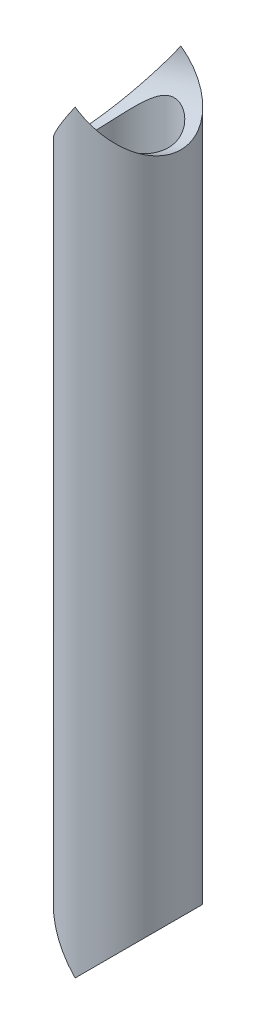
ISO-10303-21;
HEADER;
FILE_DESCRIPTION(('STEP AP214'),'2;1');
FILE_NAME('part.step','',(''),(''),'','','');
FILE_SCHEMA(('AUTOMOTIVE_DESIGN { 1 0 10303 214 1 1 1 1 }'));
ENDSEC;
DATA;
#1=APPLICATION_CONTEXT('core data for automotive mechanical design processes');
#2=APPLICATION_PROTOCOL_DEFINITION('international standard','automotive_design',2000,#1);
#3=PRODUCT_CONTEXT('',#1,'mechanical');
#4=PRODUCT('Part','Part','',(#3));
#5=PRODUCT_RELATED_PRODUCT_CATEGORY('part','',(#4));
#6=PRODUCT_DEFINITION_FORMATION('','',#4);
#7=PRODUCT_DEFINITION_CONTEXT('part definition',#1,'design');
#8=PRODUCT_DEFINITION('design','',#6,#7);
#9=PRODUCT_DEFINITION_SHAPE('','',#8);
#10=(LENGTH_UNIT() NAMED_UNIT(*) SI_UNIT(.MILLI.,.METRE.));
#11=(NAMED_UNIT(*) PLANE_ANGLE_UNIT() SI_UNIT($,.RADIAN.));
#12=(NAMED_UNIT(*) SI_UNIT($,.STERADIAN.) SOLID_ANGLE_UNIT());
#13=UNCERTAINTY_MEASURE_WITH_UNIT(LENGTH_MEASURE(1.E-05),#10,'distance_accuracy_value','');
#14=(GEOMETRIC_REPRESENTATION_CONTEXT(3) GLOBAL_UNCERTAINTY_ASSIGNED_CONTEXT((#13)) GLOBAL_UNIT_ASSIGNED_CONTEXT((#10,
#11,#12)) REPRESENTATION_CONTEXT('',''));
#15=CARTESIAN_POINT('',(0.,0.,0.));
#16=DIRECTION('',(0.,0.,1.));
#17=DIRECTION('',(1.,0.,0.));
#18=AXIS2_PLACEMENT_3D('',#15,#16,#17);
#19=CARTESIAN_POINT('',(2299.99999999996,181.249999999997,-275.000000000001));
#20=DIRECTION('',(0.,-1.,0.));
#21=DIRECTION('',(0.,0.,-1.));
#22=AXIS2_PLACEMENT_3D('',#19,#20,#21);
#23=CYLINDRICAL_SURFACE('',#22,12.6999999999999);
#24=CARTESIAN_POINT('',(2299.99999999996,181.249999999996,-275.000000000001));
#25=DIRECTION('',(0.818779373097968,-0.57410829831078,0.));
#26=DIRECTION('',(-0.574108298310781,-0.818779373097967,0.));
#27=AXIS2_PLACEMENT_3D('',#24,#25,#26);
#28=ELLIPSE('',#27,22.1212618548932,12.6999999999999);
#29=CARTESIAN_POINT('',(2299.99999999996,181.249999999997,-287.700000000001));
#30=VERTEX_POINT('',#29);
#31=CARTESIAN_POINT('',(2299.99999999996,181.249999999997,-262.300000000001));
#32=VERTEX_POINT('',#31);
#33=EDGE_CURVE('E58',#30,#32,#28,.F.);
#34=ORIENTED_EDGE('',*,*,#33,.F.);
#35=CARTESIAN_POINT('',(2299.99999999996,181.249999999996,-275.000000000001));
#36=DIRECTION('',(-0.574108298310781,-0.818779373097967,0.));
#37=DIRECTION('',(0.818779373097968,-0.57410829831078,0.));
#38=AXIS2_PLACEMENT_3D('',#35,#36,#37);
#39=ELLIPSE('',#38,15.5108939199918,12.6999999999999);
#40=EDGE_CURVE('E93',#32,#30,#39,.F.);
#41=ORIENTED_EDGE('',*,*,#40,.F.);
#42=EDGE_LOOP('',(#34,#41));
#43=FACE_BOUND('',#42,.T.);
#44=CARTESIAN_POINT('',(2299.99999999996,-1.51267887105178E-12,-275.000000000001));
#45=DIRECTION('',(0.70710678118655,-0.707106781186546,0.));
#46=DIRECTION('',(-0.707106781186546,-0.707106781186549,0.));
#47=AXIS2_PLACEMENT_3D('',#44,#45,#46);
#48=ELLIPSE('',#47,17.9605122421383,12.6999999999999);
#49=CARTESIAN_POINT('',(2299.99999999996,-1.5404344466674E-12,-287.700000000001));
#50=VERTEX_POINT('',#49);
#51=CARTESIAN_POINT('',(2299.99999999996,-4.16333634234434E-12,-262.300000000001));
#52=VERTEX_POINT('',#51);
#53=EDGE_CURVE('E75',#50,#52,#48,.T.);
#54=ORIENTED_EDGE('',*,*,#53,.F.);
#55=CARTESIAN_POINT('',(2299.99999999996,-1.51267887105178E-12,-275.000000000001));
#56=DIRECTION('',(-0.707106781186546,-0.707106781186549,0.));
#57=DIRECTION('',(0.70710678118655,-0.707106781186546,0.));
#58=AXIS2_PLACEMENT_3D('',#55,#56,#57);
#59=ELLIPSE('',#58,17.9605122421382,12.6999999999999);
#60=EDGE_CURVE('E82',#52,#50,#59,.T.);
#61=ORIENTED_EDGE('',*,*,#60,.F.);
#62=EDGE_LOOP('',(#54,#61));
#63=FACE_BOUND('',#62,.T.);
#64=ADVANCED_FACE('F44',(#43,#63),#23,.T.);
#65=CARTESIAN_POINT('',(1799.99999999996,-4.20496970576778E-12,-275.000000000001));
#66=DIRECTION('',(0.940136065162483,0.3407993236214,0.));
#67=DIRECTION('',(-0.3407993236214,0.940136065162483,0.));
#68=AXIS2_PLACEMENT_3D('',#65,#66,#67);
#69=CYLINDRICAL_SURFACE('',#68,12.7);
#70=CARTESIAN_POINT('',(2299.99999999996,172.467908247635,-284.650000000001));
#71=CARTESIAN_POINT('',(2299.73053482446,172.370218189027,-284.649997759306));
#72=CARTESIAN_POINT('',(2299.46554248098,172.260056766113,-284.638694372456));
#73=CARTESIAN_POINT('',(2298.94662265408,172.019153605129,-284.595878168783));
#74=CARTESIAN_POINT('',(2298.69270935676,171.888386416019,-284.564340209438));
#75=CARTESIAN_POINT('',(2298.1952072461,171.610087485636,-284.483098979186));
#76=CARTESIAN_POINT('',(2297.95169548143,171.46245317265,-284.433279994711));
#77=CARTESIAN_POINT('',(2297.4764958178,171.15532292964,-284.317415065042));
#78=CARTESIAN_POINT('',(2297.24480572008,170.99582921905,-284.251372150784));
#79=CARTESIAN_POINT('',(2296.70031175359,170.60176101783,-284.07450685215));
#80=CARTESIAN_POINT('',(2296.39287128243,170.36304733443,-283.956398954751));
#81=CARTESIAN_POINT('',(2295.79746676399,169.876438195739,-283.692940414183));
#82=CARTESIAN_POINT('',(2295.50951387501,169.628537603784,-283.547574340008));
#83=CARTESIAN_POINT('',(2294.95184407707,169.129663568345,-283.230515777692));
#84=CARTESIAN_POINT('',(2294.68211252106,168.878692789196,-283.058844806216));
#85=CARTESIAN_POINT('',(2294.16001321391,168.378499187879,-282.688911920102));
#86=CARTESIAN_POINT('',(2293.9076385082,168.129275701977,-282.490660750671));
#87=CARTESIAN_POINT('',(2293.46834534704,167.685553799704,-282.108252687632));
#88=CARTESIAN_POINT('',(2293.27830943162,167.489924907236,-281.928981075182));
#89=CARTESIAN_POINT('',(2292.91021399962,167.105291024418,-281.551861442901));
#90=CARTESIAN_POINT('',(2292.73215545709,166.916286573392,-281.354011915367));
#91=CARTESIAN_POINT('',(2292.38954262194,166.548141986001,-280.939324997215));
#92=CARTESIAN_POINT('',(2292.22496102757,166.368982161477,-280.722527931348));
#93=CARTESIAN_POINT('',(2291.91073877806,166.023518665575,-280.269013329519));
#94=CARTESIAN_POINT('',(2291.76109145339,165.857209262865,-280.032304773692));
#95=CARTESIAN_POINT('',(2291.42811875588,165.484212809176,-279.449133380189));
#96=CARTESIAN_POINT('',(2291.25201934174,165.28449610461,-279.093800231935));
#97=CARTESIAN_POINT('',(2291.01788618172,165.017004988662,-278.533432042647));
#98=CARTESIAN_POINT('',(2290.94485426117,164.93320005845,-278.342115872068));
#99=CARTESIAN_POINT('',(2290.80987402723,164.777818732797,-277.950741999339));
#100=CARTESIAN_POINT('',(2290.74792389831,164.706240334358,-277.750685735781));
#101=CARTESIAN_POINT('',(2290.64532866594,164.587410751901,-277.375727045156));
#102=CARTESIAN_POINT('',(2290.60285878446,164.53809782102,-277.201974600978));
#103=CARTESIAN_POINT('',(2290.52724317586,164.450159626415,-276.849808707908));
#104=CARTESIAN_POINT('',(2290.49409554138,164.411532176434,-276.671396220652));
#105=CARTESIAN_POINT('',(2290.43772976295,164.345777021796,-276.311004460584));
#106=CARTESIAN_POINT('',(2290.41450644775,164.318643328177,-276.129027097142));
#107=CARTESIAN_POINT('',(2290.37842269942,164.276458788866,-275.762646568441));
#108=CARTESIAN_POINT('',(2290.365562346,164.261408036111,-275.578243384535));
#109=CARTESIAN_POINT('',(2290.35045422322,164.243724881254,-275.207875761226));
#110=CARTESIAN_POINT('',(2290.34823683894,164.241128034375,-275.021908368404));
#111=CARTESIAN_POINT('',(2290.3545451394,164.248513004529,-274.650407901026));
#112=CARTESIAN_POINT('',(2290.36307085271,164.258494855011,-274.464874827626));
#113=CARTESIAN_POINT('',(2290.39068647275,164.290798807495,-274.095631182327));
#114=CARTESIAN_POINT('',(2290.40977958537,164.313124654349,-273.911921180728));
#115=CARTESIAN_POINT('',(2290.45814082542,164.36959754008,-273.547698809239));
#116=CARTESIAN_POINT('',(2290.48740903575,164.403744675258,-273.367186465411));
#117=CARTESIAN_POINT('',(2290.55434681284,164.481697765372,-273.01687371838));
#118=CARTESIAN_POINT('',(2290.59167801869,164.525114076771,-272.846921196638));
#119=CARTESIAN_POINT('',(2290.67470231858,164.62145879688,-272.51179726154));
#120=CARTESIAN_POINT('',(2290.7203979906,164.674390138094,-272.346627340442));
#121=CARTESIAN_POINT('',(2290.8690598963,164.846137884352,-271.859354085998));
#122=CARTESIAN_POINT('',(2290.98363651566,164.977949601629,-271.545306792955));
#123=CARTESIAN_POINT('',(2291.31041125978,165.35107940232,-270.772028486017));
#124=CARTESIAN_POINT('',(2291.54129786457,165.612324908465,-270.33030385345));
#125=CARTESIAN_POINT('',(2291.92329019123,166.037194799253,-269.713398596103));
#126=CARTESIAN_POINT('',(2292.05684633344,166.184623291186,-269.515051232876));
#127=CARTESIAN_POINT('',(2292.33466133954,166.488321702911,-269.133078115759));
#128=CARTESIAN_POINT('',(2292.47891986943,166.644591346763,-268.94945190284));
#129=CARTESIAN_POINT('',(2292.84455761016,167.036171481727,-268.516565852519));
#130=CARTESIAN_POINT('',(2293.0712854897,167.275238390509,-268.275225365091));
#131=CARTESIAN_POINT('',(2293.54309049028,167.76229425933,-267.820995665739));
#132=CARTESIAN_POINT('',(2293.78817765643,168.010288064522,-267.608122209324));
#133=CARTESIAN_POINT('',(2294.29602912652,168.510492327589,-267.209523819256));
#134=CARTESIAN_POINT('',(2294.55880902725,168.762706354603,-267.023823309438));
#135=CARTESIAN_POINT('',(2295.10199813402,169.266241985688,-266.679210978262));
#136=CARTESIAN_POINT('',(2295.3823999999,169.517563915863,-266.520288103288));
#137=CARTESIAN_POINT('',(2295.88312564491,169.946335024737,-266.26905215604));
#138=CARTESIAN_POINT('',(2296.09901438737,170.125262695582,-266.170385637131));
#139=CARTESIAN_POINT('',(2296.54158878963,170.477335026015,-265.987829743365));
#140=CARTESIAN_POINT('',(2296.76827515228,170.650479307888,-265.903941332144));
#141=CARTESIAN_POINT('',(2297.23271049986,170.987508301407,-265.752072536941));
#142=CARTESIAN_POINT('',(2297.47043127628,171.151414482954,-265.684054007376));
#143=CARTESIAN_POINT('',(2297.95819292835,171.466641412139,-265.565145386283));
#144=CARTESIAN_POINT('',(2298.20822810032,171.617967900637,-265.514247448949));
#145=CARTESIAN_POINT('',(2298.63986546246,171.858377782197,-265.444685248814));
#146=CARTESIAN_POINT('',(2298.8181143464,171.952015177421,-265.420917602166));
#147=CARTESIAN_POINT('',(2299.18032461408,172.129673692137,-265.383151750566));
#148=CARTESIAN_POINT('',(2299.36428407882,172.213697998511,-265.369150300084));
#149=CARTESIAN_POINT('',(2299.73718388123,172.370416599529,-265.351777100898));
#150=CARTESIAN_POINT('',(2299.92611672571,172.443126912917,-265.348390191191));
#151=CARTESIAN_POINT('',(2300.30827256465,172.575886347668,-265.35303313427));
#152=CARTESIAN_POINT('',(2300.50149544033,172.635935819132,-265.361062671318));
#153=CARTESIAN_POINT('',(2300.89241144788,172.742704146845,-265.389339259386));
#154=CARTESIAN_POINT('',(2301.09012801355,172.789312119353,-265.409683871265));
#155=CARTESIAN_POINT('',(2301.48672693155,172.868035297717,-265.463115115684));
#156=CARTESIAN_POINT('',(2301.68560928388,172.90015050359,-265.496201748208));
#157=CARTESIAN_POINT('',(2302.08273056967,172.950131055175,-265.57525856253));
#158=CARTESIAN_POINT('',(2302.2809689797,172.967986791114,-265.621237404525));
#159=CARTESIAN_POINT('',(2302.6748151356,172.990337576116,-265.725875317573));
#160=CARTESIAN_POINT('',(2302.87042282271,172.994832327219,-265.784534671379));
#161=CARTESIAN_POINT('',(2303.23962355314,172.992041803571,-265.908153032472));
#162=CARTESIAN_POINT('',(2303.41358786701,172.985801033579,-265.972037872669));
#163=CARTESIAN_POINT('',(2303.75713296598,172.964784037057,-266.109514572788));
#164=CARTESIAN_POINT('',(2303.92671213693,172.950004712946,-266.183109947975));
#165=CARTESIAN_POINT('',(2304.42784557373,172.894881000918,-266.41788967582));
#166=CARTESIAN_POINT('',(2304.75180715099,172.843750616685,-266.593071461264));
#167=CARTESIAN_POINT('',(2305.29455959348,172.738691671621,-266.927569865762));
#168=CARTESIAN_POINT('',(2305.51894260648,172.688877981324,-267.079345713224));
#169=CARTESIAN_POINT('',(2305.9533140424,172.582717481231,-267.400431113796));
#170=CARTESIAN_POINT('',(2306.1632974197,172.526368399866,-267.569746761184));
#171=CARTESIAN_POINT('',(2306.56805994898,172.410216054049,-267.924994202727));
#172=CARTESIAN_POINT('',(2306.76282201821,172.350409036068,-268.110944177614));
#173=CARTESIAN_POINT('',(2307.1360210879,172.230065475426,-268.498306765165));
#174=CARTESIAN_POINT('',(2307.31445975823,172.169529008104,-268.69971779229));
#175=CARTESIAN_POINT('',(2307.65542013288,172.04955086513,-269.118627955483));
#176=CARTESIAN_POINT('',(2307.81780830623,171.990121251027,-269.336239300013));
#177=CARTESIAN_POINT('',(2308.12407224244,171.874876942633,-269.785045492319));
#178=CARTESIAN_POINT('',(2308.26794760491,171.819062326536,-270.01624063372));
#179=CARTESIAN_POINT('',(2308.53601675936,171.712858274085,-270.490773445517));
#180=CARTESIAN_POINT('',(2308.6602231113,171.662465382248,-270.734103235526));
#181=CARTESIAN_POINT('',(2308.88797143843,171.568601012514,-271.231541280481));
#182=CARTESIAN_POINT('',(2308.99151404021,171.525129324751,-271.485649208313));
#183=CARTESIAN_POINT('',(2309.17596447705,171.446803545576,-272.000309645774));
#184=CARTESIAN_POINT('',(2309.25708937214,171.411867223489,-272.260771700066));
#185=CARTESIAN_POINT('',(2309.39717759498,171.351074650212,-272.788640060479));
#186=CARTESIAN_POINT('',(2309.45614087054,171.325218420398,-273.056046382947));
#187=CARTESIAN_POINT('',(2309.55118338372,171.283354255913,-273.595577187641));
#188=CARTESIAN_POINT('',(2309.58726964824,171.267343297212,-273.867700194679));
#189=CARTESIAN_POINT('',(2309.63612579955,171.245633474846,-274.414432680925));
#190=CARTESIAN_POINT('',(2309.64889736631,171.239933868183,-274.689041979547));
#191=CARTESIAN_POINT('',(2309.65088296246,171.239048242282,-275.216286119155));
#192=CARTESIAN_POINT('',(2309.64190620818,171.243054778942,-275.468914908257));
#193=CARTESIAN_POINT('',(2309.60420102593,171.25982506276,-275.972388783244));
#194=CARTESIAN_POINT('',(2309.57547380336,171.272588275492,-276.223233977039));
#195=CARTESIAN_POINT('',(2309.49858332921,171.306549698006,-276.721310895051));
#196=CARTESIAN_POINT('',(2309.4504222859,171.327746949419,-276.968543026516));
#197=CARTESIAN_POINT('',(2309.33516071545,171.378048039254,-277.457727559054));
#198=CARTESIAN_POINT('',(2309.26805983618,171.407152024675,-277.699679861876));
#199=CARTESIAN_POINT('',(2309.11609287312,171.472318525363,-278.175090948703));
#200=CARTESIAN_POINT('',(2309.03135271699,171.508331580853,-278.408596860839));
#201=CARTESIAN_POINT('',(2308.84456786848,171.586563518522,-278.867491595145));
#202=CARTESIAN_POINT('',(2308.7425233619,171.628782334068,-279.092880504438));
#203=CARTESIAN_POINT('',(2308.52188363618,171.718402201551,-279.534416350076));
#204=CARTESIAN_POINT('',(2308.40328306147,171.765804929307,-279.750560266165));
#205=CARTESIAN_POINT('',(2308.15035595184,171.864588914034,-280.172495483765));
#206=CARTESIAN_POINT('',(2308.01602824801,171.915970466636,-280.378286014133));
#207=CARTESIAN_POINT('',(2307.72198117068,172.025241981729,-280.793347092175));
#208=CARTESIAN_POINT('',(2307.56112013454,172.083332540011,-281.001756696156));
#209=CARTESIAN_POINT('',(2307.22308401382,172.200635477715,-281.404584734734));
#210=CARTESIAN_POINT('',(2307.04590728267,172.259847969885,-281.599001753662));
#211=CARTESIAN_POINT('',(2306.67602514394,172.377219563241,-281.972975644404));
#212=CARTESIAN_POINT('',(2306.48331318166,172.435378206973,-282.152526178222));
#213=CARTESIAN_POINT('',(2306.0832488222,172.548061362866,-282.495733766435));
#214=CARTESIAN_POINT('',(2305.87589869451,172.602586435834,-282.65939327525));
#215=CARTESIAN_POINT('',(2305.47957070307,172.697326296517,-282.946531596886));
#216=CARTESIAN_POINT('',(2305.29250807008,172.738460546252,-283.072354015057));
#217=CARTESIAN_POINT('',(2304.9090248277,172.8138345128,-283.311135434399));
#218=CARTESIAN_POINT('',(2304.71260588048,172.848075448621,-283.424096708387));
#219=CARTESIAN_POINT('',(2304.31147985033,172.907271483493,-283.636263101621));
#220=CARTESIAN_POINT('',(2304.10678568848,172.932240482794,-283.735488671849));
#221=CARTESIAN_POINT('',(2303.68996362096,172.970437408307,-283.919558771418));
#222=CARTESIAN_POINT('',(2303.47783756582,172.98366823601,-284.004406850452));
#223=CARTESIAN_POINT('',(2303.08608674462,172.994805726513,-284.145153786568));
#224=CARTESIAN_POINT('',(2302.90741147709,172.995024265337,-284.203516869633));
#225=CARTESIAN_POINT('',(2302.54726008047,172.984624801551,-284.309628681743));
#226=CARTESIAN_POINT('',(2302.36578458159,172.974009203211,-284.357379762901));
#227=CARTESIAN_POINT('',(2302.00158871129,172.941034164224,-284.441983273501));
#228=CARTESIAN_POINT('',(2301.81887013265,172.918689094121,-284.478848953192));
#229=CARTESIAN_POINT('',(2301.45352041814,172.861792199778,-284.541704668761));
#230=CARTESIAN_POINT('',(2301.2708892728,172.827244186212,-284.567698094244));
#231=CARTESIAN_POINT('',(2300.90500623726,172.745502459949,-284.609253783223));
#232=CARTESIAN_POINT('',(2300.72177211717,172.698165416768,-284.624690345882));
#233=CARTESIAN_POINT('',(2300.35837474745,172.591667069626,-284.645060112606));
#234=CARTESIAN_POINT('',(2300.17820921882,172.532514996919,-284.650001481872));
#235=CARTESIAN_POINT('',(2299.99999999996,172.467908247635,-284.650000000001));
#236=B_SPLINE_CURVE_WITH_KNOTS('',3,(#70,#71,#72,#73,#74,#75,#76,#77,#78,#79,#80,#81,#82,#83,
#84,#85,#86,#87,#88,#89,#90,#91,#92,#93,#94,#95,#96,#97,#98,#99,#100,#101,#102,#103,#104,#105,
#106,#107,#108,#109,#110,#111,#112,#113,#114,#115,#116,#117,#118,#119,#120,#121,#122,#123,#124,
#125,#126,#127,#128,#129,#130,#131,#132,#133,#134,#135,#136,#137,#138,#139,#140,#141,#142,#143,
#144,#145,#146,#147,#148,#149,#150,#151,#152,#153,#154,#155,#156,#157,#158,#159,#160,#161,#162,
#163,#164,#165,#166,#167,#168,#169,#170,#171,#172,#173,#174,#175,#176,#177,#178,#179,#180,#181,
#182,#183,#184,#185,#186,#187,#188,#189,#190,#191,#192,#193,#194,#195,#196,#197,#198,#199,#200,
#201,#202,#203,#204,#205,#206,#207,#208,#209,#210,#211,#212,#213,#214,#215,#216,#217,#218,#219,
#220,#221,#222,#223,#224,#225,#226,#227,#228,#229,#230,#231,#232,#233,#234,#235),.UNSPECIFIED.,
.T.,.F.,(4,2,2,2,2,2,2,2,2,2,2,2,2,2,2,2,2,2,2,2,2,2,2,2,2,2,2,2,2,2,2,2,2,2,2,2,2,2,2,2,2,2,2,
2,2,2,2,2,2,2,2,2,2,2,2,2,2,2,2,2,2,2,2,2,2,2,2,2,2,2,2,2,2,2,2,2,2,2,2,2,2,2,4),(0.,
0.85956480092131,1.72019973033594,2.58637893968347,3.45239645340109,4.67086270441151,
5.89002082984862,7.10818698994395,8.32586217554469,9.30426642642538,10.2827501491396,
11.2591999090223,12.2352116246843,13.5620039284862,14.2251760081481,14.8882393400177,
15.4443119321435,16.0002706671357,16.555939355651,17.111612318181,17.6688707561132,
18.2261306758476,18.7835597467798,19.340993358886,19.8784665437069,20.4161056610598,
21.4908238050822,23.1690661221741,24.0113241392334,24.8535558831466,26.0770645424319,
27.3012475929254,28.5265243035212,29.7512939829841,30.6425157624065,31.5337956343069,
32.4229105913923,33.3116175392895,33.9193878144768,34.5269560173332,35.1336560195331,
35.7403392429389,36.3518927260381,36.9634462083925,37.5754114831919,38.1873904051506,
38.7431350958184,39.2990815239091,40.4109386475581,41.2363370250298,42.0620231588261,
42.8886230295086,43.7151382448649,44.5480349241406,45.3809496137405,46.2133302688706,
47.0456856795554,47.8696743510834,48.6936649623993,49.5174023536227,50.3410803869932,
51.0986209696201,51.8561153230385,52.6135236262341,53.370946011955,54.1231359800807,
54.8753178723953,55.6277436475559,56.3802253823081,57.1881546687048,57.9961655810247,
58.8045192159797,59.6127477989008,60.2996371955591,60.986405016436,61.6721390557604,
62.3577035451617,62.9210191383646,63.4842097498882,64.0467119646701,64.6090386790996,
65.1779496080388,65.74641776516),.UNSPECIFIED.);
#237=CARTESIAN_POINT('',(2299.99999999996,172.467908247635,-284.650000000001));
#238=VERTEX_POINT('',#237);
#239=EDGE_CURVE('E11',#238,#238,#236,.T.);
#240=ORIENTED_EDGE('',*,*,#239,.F.);
#241=EDGE_LOOP('',(#240));
#242=FACE_BOUND('',#241,.T.);
#243=ORIENTED_EDGE('',*,*,#33,.T.);
#244=ORIENTED_EDGE('',*,*,#40,.T.);
#245=EDGE_LOOP('',(#243,#244));
#246=FACE_BOUND('',#245,.T.);
#247=ADVANCED_FACE('F102',(#242,#246),#69,.F.);
#248=CARTESIAN_POINT('',(1799.99999999996,-4.12170297892089E-12,-275.000000000001));
#249=DIRECTION('',(1.,0.,0.));
#250=DIRECTION('',(0.,1.,0.));
#251=AXIS2_PLACEMENT_3D('',#248,#249,#250);
#252=CYLINDRICAL_SURFACE('',#251,12.7);
#253=CARTESIAN_POINT('',(2299.99999999996,8.25636118395842,-284.650000000001));
#254=CARTESIAN_POINT('',(2300.2238809479,8.25636650160305,-284.649997471153));
#255=CARTESIAN_POINT('',(2300.44779598858,8.26552111122355,-284.642185976445));
#256=CARTESIAN_POINT('',(2300.89312189135,8.30155650462335,-284.611175788682));
#257=CARTESIAN_POINT('',(2301.11453214946,8.32844147486633,-284.587973461561));
#258=CARTESIAN_POINT('',(2301.55330914591,8.39840451080104,-284.526749222472));
#259=CARTESIAN_POINT('',(2301.7706625495,8.44152854567089,-284.488685229058));
#260=CARTESIAN_POINT('',(2302.19920636251,8.54169432810287,-284.398615818278));
#261=CARTESIAN_POINT('',(2302.41039430787,8.59874155714344,-284.346604909298));
#262=CARTESIAN_POINT('',(2302.86846446711,8.73719433783208,-284.217490354832));
#263=CARTESIAN_POINT('',(2303.11372202509,8.82119710367517,-284.13742362549));
#264=CARTESIAN_POINT('',(2303.59306589356,9.00156935271057,-283.959785989283));
#265=CARTESIAN_POINT('',(2303.82714896829,9.09794238847478,-283.862210050796));
#266=CARTESIAN_POINT('',(2304.28407961302,9.29939516527677,-283.650584442118));
#267=CARTESIAN_POINT('',(2304.50691688092,9.40448266467971,-283.536520023855));
#268=CARTESIAN_POINT('',(2304.94106326866,9.62008904980574,-283.292789857837));
#269=CARTESIAN_POINT('',(2305.15237338134,9.73060746620049,-283.163125456802));
#270=CARTESIAN_POINT('',(2305.56830672249,9.95702736946201,-282.885458668398));
#271=CARTESIAN_POINT('',(2305.77265217323,10.0729943631192,-282.737094058676));
#272=CARTESIAN_POINT('',(2306.16900131329,10.3052560033119,-282.424927970279));
#273=CARTESIAN_POINT('',(2306.36100460787,10.4215506602032,-282.261125998283));
#274=CARTESIAN_POINT('',(2306.73207460018,10.6520993133467,-281.91848178545));
#275=CARTESIAN_POINT('',(2306.91115144745,10.7663548564068,-281.739651588531));
#276=CARTESIAN_POINT('',(2307.25584339355,10.9907989746195,-281.367074058027));
#277=CARTESIAN_POINT('',(2307.42145912612,11.1009877410927,-281.173327427507));
#278=CARTESIAN_POINT('',(2307.73163925038,11.3107584124202,-280.779652355224));
#279=CARTESIAN_POINT('',(2307.87679554221,11.4105914116386,-280.58032497267));
#280=CARTESIAN_POINT('',(2308.15284148754,11.6028668966314,-280.168662733001));
#281=CARTESIAN_POINT('',(2308.2837332496,11.6953104741548,-279.956329805607));
#282=CARTESIAN_POINT('',(2308.53006644363,11.8710609081059,-279.519225052687));
#283=CARTESIAN_POINT('',(2308.64550703063,11.9543672648045,-279.294452547831));
#284=CARTESIAN_POINT('',(2308.85958379957,12.1100921094653,-278.833388187829));
#285=CARTESIAN_POINT('',(2308.95822011415,12.1825106833701,-278.597096423631));
#286=CARTESIAN_POINT('',(2309.13812450243,12.3154012305782,-278.112025500927));
#287=CARTESIAN_POINT('',(2309.21922217784,12.3757555998474,-277.863150502245));
#288=CARTESIAN_POINT('',(2309.36148671678,12.4820951324542,-277.356740010992));
#289=CARTESIAN_POINT('',(2309.42265328476,12.5280800827093,-277.099204390056));
#290=CARTESIAN_POINT('',(2309.52380445426,12.6043344622585,-276.577987368538));
#291=CARTESIAN_POINT('',(2309.56381126087,12.6346203654824,-276.314312714946));
#292=CARTESIAN_POINT('',(2309.62187152846,12.6786256550751,-275.783203892268));
#293=CARTESIAN_POINT('',(2309.63992898451,12.6923480562058,-275.515770416301));
#294=CARTESIAN_POINT('',(2309.65264386903,12.7020088617574,-275.021175400174));
#295=CARTESIAN_POINT('',(2309.65046784581,12.7003538689969,-274.79413372961));
#296=CARTESIAN_POINT('',(2309.63015326612,12.6849243541179,-274.341198970451));
#297=CARTESIAN_POINT('',(2309.61201665637,12.6711513100522,-274.115305745158));
#298=CARTESIAN_POINT('',(2309.56007469284,12.6317948960897,-273.666381089012));
#299=CARTESIAN_POINT('',(2309.52626931532,12.606211508297,-273.443349662496));
#300=CARTESIAN_POINT('',(2309.44350913262,12.5437883797093,-273.00172338559));
#301=CARTESIAN_POINT('',(2309.39455392064,12.5069483366488,-272.783128654502));
#302=CARTESIAN_POINT('',(2309.28397177702,12.4241029996189,-272.358607568935));
#303=CARTESIAN_POINT('',(2309.2227951782,12.378424859462,-272.152499248937));
#304=CARTESIAN_POINT('',(2309.08760165531,12.2780272819771,-271.746732946512));
#305=CARTESIAN_POINT('',(2309.01358031607,12.2233047360879,-271.547077210142));
#306=CARTESIAN_POINT('',(2308.85351814761,12.1057562302849,-271.155197630732));
#307=CARTESIAN_POINT('',(2308.76748087384,12.0429326678354,-270.962971610684));
#308=CARTESIAN_POINT('',(2308.58412444449,11.9101090414245,-270.586478532353));
#309=CARTESIAN_POINT('',(2308.48680124829,11.8401064082424,-270.402214357194));
#310=CARTESIAN_POINT('',(2308.26814620199,11.6843101232695,-270.018512269001));
#311=CARTESIAN_POINT('',(2308.14534017242,11.5976504909959,-269.820265801703));
#312=CARTESIAN_POINT('',(2307.88721125462,11.4178378866164,-269.435093917832));
#313=CARTESIAN_POINT('',(2307.75188304738,11.3246821593599,-269.248173368441));
#314=CARTESIAN_POINT('',(2307.46946263948,11.1332644182827,-268.885882271667));
#315=CARTESIAN_POINT('',(2307.32235896641,11.0349974582244,-268.710523299163));
#316=CARTESIAN_POINT('',(2307.01725064134,10.8349454704604,-268.371829999691));
#317=CARTESIAN_POINT('',(2306.85924881123,10.7331613568393,-268.208492582431));
#318=CARTESIAN_POINT('',(2306.49945938943,10.5065279577586,-267.861788650838));
#319=CARTESIAN_POINT('',(2306.295323438,10.3812168353868,-267.681152848841));
#320=CARTESIAN_POINT('',(2305.87255427908,10.1304200601689,-267.337767354395));
#321=CARTESIAN_POINT('',(2305.65391758764,10.0049343725236,-267.175021985438));
#322=CARTESIAN_POINT('',(2305.20247270437,9.75692814531907,-266.867885866329));
#323=CARTESIAN_POINT('',(2304.96966483976,9.63440753738503,-266.7234946926));
#324=CARTESIAN_POINT('',(2304.49016381972,9.39605116186092,-266.453852671959));
#325=CARTESIAN_POINT('',(2304.24347572457,9.2802129888704,-266.328594910715));
#326=CARTESIAN_POINT('',(2303.62370514064,9.01055914500794,-266.047202974483));
#327=CARTESIAN_POINT('',(2303.24290764359,8.86255803907158,-265.901855106179));
#328=CARTESIAN_POINT('',(2302.65189314292,8.66980372388422,-265.719244871426));
#329=CARTESIAN_POINT('',(2302.45173328474,8.61045838748207,-265.664302996782));
#330=CARTESIAN_POINT('',(2302.04523823548,8.50365137150217,-265.566913154354));
#331=CARTESIAN_POINT('',(2301.83890426745,8.45618735549764,-265.524462729875));
#332=CARTESIAN_POINT('',(2301.45431956732,8.3816947351774,-265.458550180121));
#333=CARTESIAN_POINT('',(2301.27679652053,8.35262020016663,-265.433145556601));
#334=CARTESIAN_POINT('',(2300.91917999003,8.30548031772598,-265.39219180822));
#335=CARTESIAN_POINT('',(2300.73908705287,8.28741266406855,-265.376640618782));
#336=CARTESIAN_POINT('',(2300.37762651766,8.26302688231353,-265.355693440158));
#337=CARTESIAN_POINT('',(2300.19625980511,8.25670127345301,-265.35029098527));
#338=CARTESIAN_POINT('',(2299.83348362387,8.25604788289179,-265.3497319337));
#339=CARTESIAN_POINT('',(2299.65207415426,8.26172039198434,-265.354575585349));
#340=CARTESIAN_POINT('',(2299.29091129821,8.28479826519297,-265.374391221174));
#341=CARTESIAN_POINT('',(2299.11115545643,8.30218175487692,-265.389344322532));
#342=CARTESIAN_POINT('',(2298.7541674946,8.34794875853338,-265.429071960344));
#343=CARTESIAN_POINT('',(2298.57693537882,8.37633229107087,-265.453846513374));
#344=CARTESIAN_POINT('',(2298.22573020293,8.44308943787645,-265.512839201216));
#345=CARTESIAN_POINT('',(2298.05176178097,8.48147626238905,-265.547069827238));
#346=CARTESIAN_POINT('',(2297.70799504505,8.56697417067242,-265.624485259924));
#347=CARTESIAN_POINT('',(2297.53819791417,8.61408769794838,-265.667672574897));
#348=CARTESIAN_POINT('',(2297.12447740184,8.73962656542303,-265.784830008542));
#349=CARTESIAN_POINT('',(2296.8832436018,8.82235793134378,-265.863725585581));
#350=CARTESIAN_POINT('',(2296.41155733376,8.99981069173787,-266.038476052039));
#351=CARTESIAN_POINT('',(2296.18111006207,9.09453778524623,-266.134339011136));
#352=CARTESIAN_POINT('',(2295.73088996493,9.29257029218158,-266.342126624723));
#353=CARTESIAN_POINT('',(2295.51113673912,9.39589058091654,-266.454079386058));
#354=CARTESIAN_POINT('',(2295.0828227744,9.60788792873918,-266.693134423815));
#355=CARTESIAN_POINT('',(2294.8742606252,9.71656430953536,-266.820234784832));
#356=CARTESIAN_POINT('',(2294.46054389006,9.94091141867814,-267.094253325404));
#357=CARTESIAN_POINT('',(2294.25582857462,10.0566904184988,-267.241745548556));
#358=CARTESIAN_POINT('',(2293.85869660894,10.2886901779402,-267.552154083836));
#359=CARTESIAN_POINT('',(2293.66628064026,10.4049109616643,-267.715071249479));
#360=CARTESIAN_POINT('',(2293.29436069032,10.6354044939347,-268.055904695521));
#361=CARTESIAN_POINT('',(2293.11484480299,10.749678962507,-268.233806807409));
#362=CARTESIAN_POINT('',(2292.76914131129,10.9743134887968,-268.604576575237));
#363=CARTESIAN_POINT('',(2292.6029580735,11.0846722575293,-268.797449093801));
#364=CARTESIAN_POINT('',(2292.29102235073,11.2952697991767,-269.190129443297));
#365=CARTESIAN_POINT('',(2292.14473046355,11.3957344296568,-269.389386815747));
#366=CARTESIAN_POINT('',(2291.86644430119,11.5893157638869,-269.801012469891));
#367=CARTESIAN_POINT('',(2291.73444788075,11.6824335695763,-270.013378776847));
#368=CARTESIAN_POINT('',(2291.48602134663,11.8595003557766,-270.45051367823));
#369=CARTESIAN_POINT('',(2291.36958199476,11.9434547722691,-270.675274799258));
#370=CARTESIAN_POINT('',(2291.15353976976,12.100489847021,-271.136396485112));
#371=CARTESIAN_POINT('',(2291.05393409963,12.1735723114707,-271.372755114515));
#372=CARTESIAN_POINT('',(2290.88647319918,12.2972021624835,-271.81970562566));
#373=CARTESIAN_POINT('',(2290.81609786775,12.3494849992028,-272.028875494399));
#374=CARTESIAN_POINT('',(2290.68938395762,12.4440061327461,-272.453625298769));
#375=CARTESIAN_POINT('',(2290.63304295173,12.4862461663767,-272.669204118768));
#376=CARTESIAN_POINT('',(2290.53516759604,12.5598372396133,-273.105431274593));
#377=CARTESIAN_POINT('',(2290.49362666938,12.5911931157549,-273.326077312136));
#378=CARTESIAN_POINT('',(2290.42592945134,12.6423825053804,-273.77105145885));
#379=CARTESIAN_POINT('',(2290.39977333548,12.6622158874029,-273.995379610002));
#380=CARTESIAN_POINT('',(2290.36320844145,12.6899609443247,-274.446695398274));
#381=CARTESIAN_POINT('',(2290.35284434057,12.6978387955096,-274.673688756615));
#382=CARTESIAN_POINT('',(2290.3481751738,12.7013865427146,-275.12793730875));
#383=CARTESIAN_POINT('',(2290.35387013945,12.6970564147694,-275.355192503058));
#384=CARTESIAN_POINT('',(2290.38122639794,12.6762860025406,-275.80820535951));
#385=CARTESIAN_POINT('',(2290.40288965421,12.6598442290505,-276.033962834053));
#386=CARTESIAN_POINT('',(2290.46183636499,12.6152168058431,-276.482242579319));
#387=CARTESIAN_POINT('',(2290.49911961789,12.5870313077139,-276.704764891762));
#388=CARTESIAN_POINT('',(2290.58686064145,12.5209383638381,-277.135800784473));
#389=CARTESIAN_POINT('',(2290.63670177084,12.4834871381322,-277.344510902725));
#390=CARTESIAN_POINT('',(2290.74958136652,12.3990460013952,-277.756424753405));
#391=CARTESIAN_POINT('',(2290.81262440323,12.3520527871496,-277.959626551293));
#392=CARTESIAN_POINT('',(2290.95115300241,12.2493661659144,-278.359407037535));
#393=CARTESIAN_POINT('',(2291.02663547874,12.1936749170194,-278.555987354097));
#394=CARTESIAN_POINT('',(2291.18931660253,12.0744597532247,-278.941854978068));
#395=CARTESIAN_POINT('',(2291.27651951303,12.0109329890162,-279.131139599435));
#396=CARTESIAN_POINT('',(2291.47155112331,11.870001273722,-279.521108768999));
#397=CARTESIAN_POINT('',(2291.58058290692,11.7918397886643,-279.720917967532));
#398=CARTESIAN_POINT('',(2291.8110636258,11.6283951565767,-280.110287204058));
#399=CARTESIAN_POINT('',(2291.93251775613,11.543109032759,-280.299842902927));
#400=CARTESIAN_POINT('',(2292.18698850641,11.3667159632159,-280.66828905598));
#401=CARTESIAN_POINT('',(2292.32000977782,11.2756066797832,-280.847175170437));
#402=CARTESIAN_POINT('',(2292.59683495495,11.0889092508834,-281.193938863954));
#403=CARTESIAN_POINT('',(2292.74064020531,10.9933205474422,-281.361815065292));
#404=CARTESIAN_POINT('',(2293.06803480299,10.779671749515,-281.718636600715));
#405=CARTESIAN_POINT('',(2293.25384888645,10.6609229956605,-281.905133270261));
#406=CARTESIAN_POINT('',(2293.63932210958,10.4212724909291,-282.261765948333));
#407=CARTESIAN_POINT('',(2293.83898381632,10.3003703439609,-282.431898909332));
#408=CARTESIAN_POINT('',(2294.25177181474,10.0589052180191,-282.755592608363));
#409=CARTESIAN_POINT('',(2294.46490697409,9.93834251813471,-282.90914224806));
#410=CARTESIAN_POINT('',(2294.90425132127,9.70051680113902,-283.19909181584));
#411=CARTESIAN_POINT('',(2295.13045792549,9.58325313873452,-283.335495116113));
#412=CARTESIAN_POINT('',(2295.55465379377,9.37554010230663,-283.567908947777));
#413=CARTESIAN_POINT('',(2295.75054553921,9.28401981570636,-283.666794833639));
#414=CARTESIAN_POINT('',(2296.15113330312,9.10763061532469,-283.851972087268));
#415=CARTESIAN_POINT('',(2296.35582946437,9.02276180946865,-283.938263250696));
#416=CARTESIAN_POINT('',(2296.77349996583,8.86231895471071,-284.09736499116));
#417=CARTESIAN_POINT('',(2296.98645924997,8.78672895755584,-284.170198810504));
#418=CARTESIAN_POINT('',(2297.42050442695,8.64749185276201,-284.301616063244));
#419=CARTESIAN_POINT('',(2297.64158677035,8.58383960131772,-284.360205637524));
#420=CARTESIAN_POINT('',(2298.03805424514,8.48463672046878,-284.45009561726));
#421=CARTESIAN_POINT('',(2298.21194929518,8.44599802469557,-284.484573277887));
#422=CARTESIAN_POINT('',(2298.56317606682,8.37868076612143,-284.544094137191));
#423=CARTESIAN_POINT('',(2298.74050581759,8.3499966602538,-284.569142587044));
#424=CARTESIAN_POINT('',(2299.09754822041,8.30365189726459,-284.609386806696));
#425=CARTESIAN_POINT('',(2299.27725837777,8.28598050830668,-284.624592169095));
#426=CARTESIAN_POINT('',(2299.63797180321,8.26233437904365,-284.644898598372));
#427=CARTESIAN_POINT('',(2299.81897475669,8.25635688422715,-284.650002044772));
#428=CARTESIAN_POINT('',(2299.99999999996,8.25636118395842,-284.650000000001));
#429=B_SPLINE_CURVE_WITH_KNOTS('',3,(#253,#254,#255,#256,#257,#258,#259,#260,#261,#262,#263,
#264,#265,#266,#267,#268,#269,#270,#271,#272,#273,#274,#275,#276,#277,#278,#279,#280,#281,#282,
#283,#284,#285,#286,#287,#288,#289,#290,#291,#292,#293,#294,#295,#296,#297,#298,#299,#300,#301,
#302,#303,#304,#305,#306,#307,#308,#309,#310,#311,#312,#313,#314,#315,#316,#317,#318,#319,#320,
#321,#322,#323,#324,#325,#326,#327,#328,#329,#330,#331,#332,#333,#334,#335,#336,#337,#338,#339,
#340,#341,#342,#343,#344,#345,#346,#347,#348,#349,#350,#351,#352,#353,#354,#355,#356,#357,#358,
#359,#360,#361,#362,#363,#364,#365,#366,#367,#368,#369,#370,#371,#372,#373,#374,#375,#376,#377,
#378,#379,#380,#381,#382,#383,#384,#385,#386,#387,#388,#389,#390,#391,#392,#393,#394,#395,#396,
#397,#398,#399,#400,#401,#402,#403,#404,#405,#406,#407,#408,#409,#410,#411,#412,#413,#414,#415,
#416,#417,#418,#419,#420,#421,#422,#423,#424,#425,#426,#427,#428),.UNSPECIFIED.,.T.,.F.,(4,2,2,
2,2,2,2,2,2,2,2,2,2,2,2,2,2,2,2,2,2,2,2,2,2,2,2,2,2,2,2,2,2,2,2,2,2,2,2,2,2,2,2,2,2,2,2,2,2,2,2,
2,2,2,2,2,2,2,2,2,2,2,2,2,2,2,2,2,2,2,2,2,2,2,2,2,2,2,2,2,2,2,2,2,2,2,2,4),(0.,
0.671388216053098,1.34293501597631,2.01639728297794,2.6901251169577,3.50284680113828,
4.31580241225155,5.12948972081659,5.94310683548711,6.77603626888332,7.60899232867235,
8.44128709329721,9.27354265277015,10.0708563004877,10.8680519306422,11.6652911389633,
12.4625240539582,13.2671854568247,14.0718587913485,14.8756860168625,15.6793669138251,
16.3596774651138,17.0399050496451,17.7201336649136,18.4003805473891,19.0590875510849,
19.718021424909,20.376760735458,21.0357366214717,21.7813767458616,22.527335060527,
23.274029193851,24.020530704747,24.9196255407808,25.8189371811312,26.7182280635424,
27.6171931921703,28.9130820785525,29.5601152219657,30.2070210280802,30.751473699066,
31.2958122538045,31.8398038956174,32.3838087220746,32.9268002325266,33.4697926593993,
34.0135058227395,34.5573714583091,35.3569857878314,36.1569814404246,36.958391964611,
37.7597012582517,38.5918172217698,39.4239792560938,40.2553631149331,41.0870181596386,
41.8867475795128,42.6863568202173,43.4854891019689,44.2844884728438,44.9641894144954,
45.6437727227465,46.3230536604054,47.002342347904,47.6835492700318,48.3647575294272,
49.0460495618427,49.7273328004142,50.380104796902,51.0331031543251,51.6859397510585,
52.3390144492581,53.0603263298722,53.7819411080624,54.5038474205456,55.2258438968064,
56.091412762528,56.9571425182029,57.8234481166152,58.6895830702312,59.4023259760534,
60.1150804442815,60.8265921595327,61.5377965865485,62.0816281586102,62.6251564183498,
63.1681541809213,63.711024024284),.UNSPECIFIED.);
#430=CARTESIAN_POINT('',(2299.99999999996,8.25636118395842,-284.650000000001));
#431=VERTEX_POINT('',#430);
#432=EDGE_CURVE('E88',#431,#431,#429,.T.);
#433=ORIENTED_EDGE('',*,*,#432,.F.);
#434=EDGE_LOOP('',(#433));
#435=FACE_BOUND('',#434,.T.);
#436=ORIENTED_EDGE('',*,*,#53,.T.);
#437=ORIENTED_EDGE('',*,*,#60,.T.);
#438=EDGE_LOOP('',(#436,#437));
#439=FACE_BOUND('',#438,.T.);
#440=ADVANCED_FACE('F83',(#435,#439),#252,.F.);
#441=CARTESIAN_POINT('',(2299.99999999996,181.249999999997,-275.000000000001));
#442=DIRECTION('',(0.,-1.,0.));
#443=DIRECTION('',(0.,0.,-1.));
#444=AXIS2_PLACEMENT_3D('',#441,#442,#443);
#445=CYLINDRICAL_SURFACE('',#444,9.64999999999982);
#446=ORIENTED_EDGE('',*,*,#239,.T.);
#447=EDGE_LOOP('',(#446));
#448=FACE_BOUND('',#447,.T.);
#449=ORIENTED_EDGE('',*,*,#432,.T.);
#450=EDGE_LOOP('',(#449));
#451=FACE_BOUND('',#450,.T.);
#452=ADVANCED_FACE('F46',(#448,#451),#445,.F.);
#453=CLOSED_SHELL('',(#64,#247,#440,#452));
#454=MANIFOLD_SOLID_BREP('B2',#453);
#455=ADVANCED_BREP_SHAPE_REPRESENTATION('',(#18,#454),#14);
#456=SHAPE_DEFINITION_REPRESENTATION(#9,#455);
ENDSEC;
END-ISO-10303-21;
